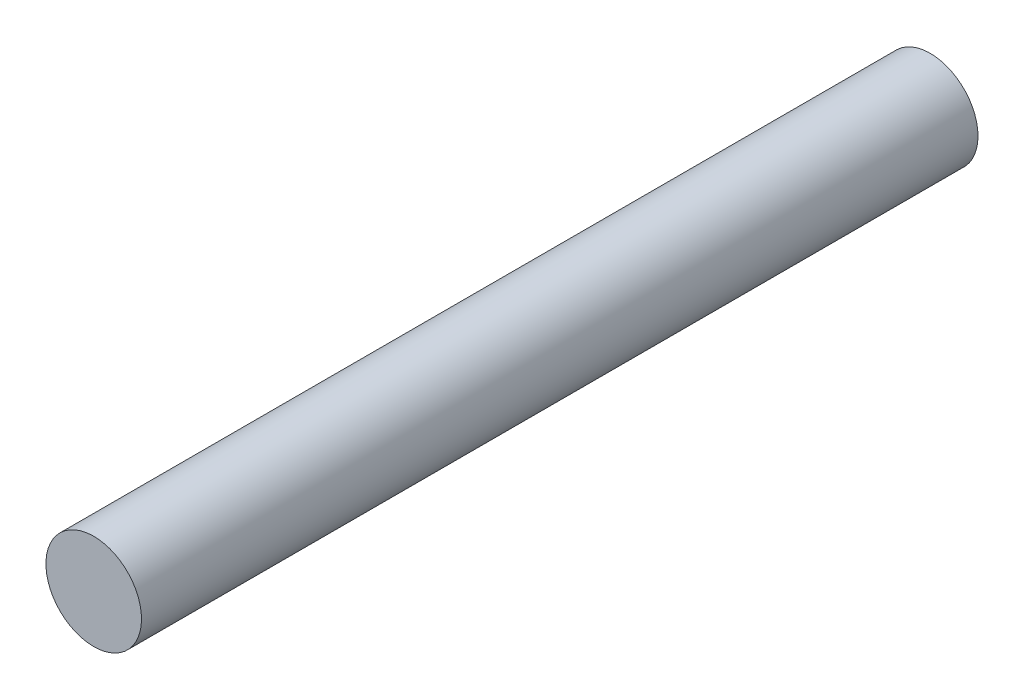
ISO-10303-21;
HEADER;
FILE_DESCRIPTION(('STEP AP214'),'2;1');
FILE_NAME('part.step','',(''),(''),'','','');
FILE_SCHEMA(('AUTOMOTIVE_DESIGN { 1 0 10303 214 1 1 1 1 }'));
ENDSEC;
DATA;
#1=APPLICATION_CONTEXT('core data for automotive mechanical design processes');
#2=APPLICATION_PROTOCOL_DEFINITION('international standard','automotive_design',2000,#1);
#3=PRODUCT_CONTEXT('',#1,'mechanical');
#4=PRODUCT('Part','Part','',(#3));
#5=PRODUCT_RELATED_PRODUCT_CATEGORY('part','',(#4));
#6=PRODUCT_DEFINITION_FORMATION('','',#4);
#7=PRODUCT_DEFINITION_CONTEXT('part definition',#1,'design');
#8=PRODUCT_DEFINITION('design','',#6,#7);
#9=PRODUCT_DEFINITION_SHAPE('','',#8);
#10=(LENGTH_UNIT() NAMED_UNIT(*) SI_UNIT(.MILLI.,.METRE.));
#11=(NAMED_UNIT(*) PLANE_ANGLE_UNIT() SI_UNIT($,.RADIAN.));
#12=(NAMED_UNIT(*) SI_UNIT($,.STERADIAN.) SOLID_ANGLE_UNIT());
#13=UNCERTAINTY_MEASURE_WITH_UNIT(LENGTH_MEASURE(1.E-05),#10,'distance_accuracy_value','');
#14=(GEOMETRIC_REPRESENTATION_CONTEXT(3) GLOBAL_UNCERTAINTY_ASSIGNED_CONTEXT((#13)) GLOBAL_UNIT_ASSIGNED_CONTEXT((#10,
#11,#12)) REPRESENTATION_CONTEXT('',''));
#15=CARTESIAN_POINT('',(0.,0.,0.));
#16=DIRECTION('',(0.,0.,1.));
#17=DIRECTION('',(1.,0.,0.));
#18=AXIS2_PLACEMENT_3D('',#15,#16,#17);
#19=CARTESIAN_POINT('',(0.,0.,70.));
#20=DIRECTION('',(0.,0.,-1.));
#21=DIRECTION('',(-1.,0.,0.));
#22=AXIS2_PLACEMENT_3D('',#19,#20,#21);
#23=CYLINDRICAL_SURFACE('',#22,4.);
#24=CARTESIAN_POINT('',(0.,0.,70.));
#25=DIRECTION('',(0.,0.,1.));
#26=DIRECTION('',(1.,0.,0.));
#27=AXIS2_PLACEMENT_3D('',#24,#25,#26);
#28=CIRCLE('',#27,4.);
#29=CARTESIAN_POINT('',(4.,0.,70.));
#30=VERTEX_POINT('',#29);
#31=EDGE_CURVE('E10',#30,#30,#28,.T.);
#32=ORIENTED_EDGE('',*,*,#31,.F.);
#33=EDGE_LOOP('',(#32));
#34=FACE_BOUND('',#33,.T.);
#35=CARTESIAN_POINT('',(0.,0.,0.));
#36=DIRECTION('',(0.,0.,1.));
#37=DIRECTION('',(1.,0.,0.));
#38=AXIS2_PLACEMENT_3D('',#35,#36,#37);
#39=CIRCLE('',#38,4.);
#40=CARTESIAN_POINT('',(4.,0.,0.));
#41=VERTEX_POINT('',#40);
#42=EDGE_CURVE('E38',#41,#41,#39,.T.);
#43=ORIENTED_EDGE('',*,*,#42,.T.);
#44=EDGE_LOOP('',(#43));
#45=FACE_BOUND('',#44,.T.);
#46=ADVANCED_FACE('F35',(#34,#45),#23,.T.);
#47=CARTESIAN_POINT('',(0.,0.,70.));
#48=DIRECTION('',(0.,0.,1.));
#49=DIRECTION('',(1.,0.,0.));
#50=AXIS2_PLACEMENT_3D('',#47,#48,#49);
#51=PLANE('',#50);
#52=ORIENTED_EDGE('',*,*,#31,.T.);
#53=EDGE_LOOP('',(#52));
#54=FACE_BOUND('',#53,.T.);
#55=ADVANCED_FACE('F50',(#54),#51,.T.);
#56=CARTESIAN_POINT('',(0.,0.,0.));
#57=DIRECTION('',(0.,0.,1.));
#58=DIRECTION('',(1.,0.,0.));
#59=AXIS2_PLACEMENT_3D('',#56,#57,#58);
#60=PLANE('',#59);
#61=ORIENTED_EDGE('',*,*,#42,.F.);
#62=EDGE_LOOP('',(#61));
#63=FACE_BOUND('',#62,.T.);
#64=ADVANCED_FACE('F48',(#63),#60,.F.);
#65=CLOSED_SHELL('',(#46,#55,#64));
#66=MANIFOLD_SOLID_BREP('B2',#65);
#67=ADVANCED_BREP_SHAPE_REPRESENTATION('',(#18,#66),#14);
#68=SHAPE_DEFINITION_REPRESENTATION(#9,#67);
ENDSEC;
END-ISO-10303-21;
